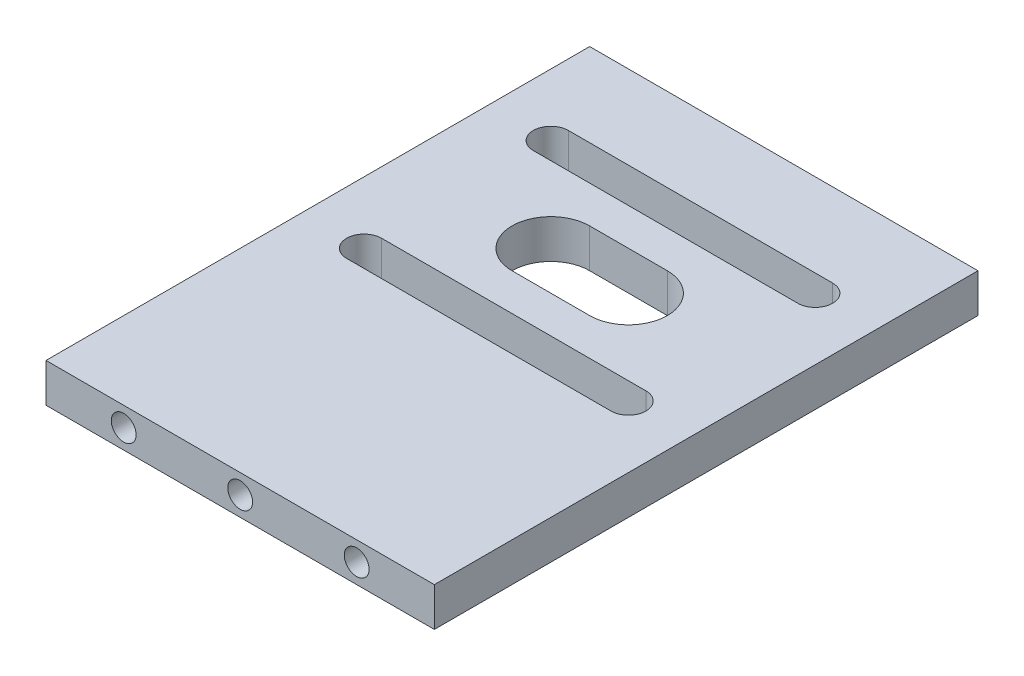
ISO-10303-21;
HEADER;
FILE_DESCRIPTION(('STEP AP214'),'2;1');
FILE_NAME('part.step','',(''),(''),'','','');
FILE_SCHEMA(('AUTOMOTIVE_DESIGN { 1 0 10303 214 1 1 1 1 }'));
ENDSEC;
DATA;
#1=APPLICATION_CONTEXT('core data for automotive mechanical design processes');
#2=APPLICATION_PROTOCOL_DEFINITION('international standard','automotive_design',2000,#1);
#3=PRODUCT_CONTEXT('',#1,'mechanical');
#4=PRODUCT('Part','Part','',(#3));
#5=PRODUCT_RELATED_PRODUCT_CATEGORY('part','',(#4));
#6=PRODUCT_DEFINITION_FORMATION('','',#4);
#7=PRODUCT_DEFINITION_CONTEXT('part definition',#1,'design');
#8=PRODUCT_DEFINITION('design','',#6,#7);
#9=PRODUCT_DEFINITION_SHAPE('','',#8);
#10=(LENGTH_UNIT() NAMED_UNIT(*) SI_UNIT(.MILLI.,.METRE.));
#11=(NAMED_UNIT(*) PLANE_ANGLE_UNIT() SI_UNIT($,.RADIAN.));
#12=(NAMED_UNIT(*) SI_UNIT($,.STERADIAN.) SOLID_ANGLE_UNIT());
#13=UNCERTAINTY_MEASURE_WITH_UNIT(LENGTH_MEASURE(1.E-05),#10,'distance_accuracy_value','');
#14=(GEOMETRIC_REPRESENTATION_CONTEXT(3) GLOBAL_UNCERTAINTY_ASSIGNED_CONTEXT((#13)) GLOBAL_UNIT_ASSIGNED_CONTEXT((#10,
#11,#12)) REPRESENTATION_CONTEXT('',''));
#15=CARTESIAN_POINT('',(0.,0.,0.));
#16=DIRECTION('',(0.,0.,1.));
#17=DIRECTION('',(1.,0.,0.));
#18=AXIS2_PLACEMENT_3D('',#15,#16,#17);
#19=CARTESIAN_POINT('',(0.,5.,0.));
#20=DIRECTION('',(0.,1.,0.));
#21=DIRECTION('',(0.,0.,1.));
#22=AXIS2_PLACEMENT_3D('',#19,#20,#21);
#23=PLANE('',#22);
#24=DIRECTION('',(0.,0.,1.));
#25=VECTOR('',#24,1.);
#26=CARTESIAN_POINT('',(-34.5750744686097,5.,-43.274395374361));
#27=LINE('',#26,#25);
#28=CARTESIAN_POINT('',(-34.5750744686097,5.,-43.274395374361));
#29=VERTEX_POINT('',#28);
#30=CARTESIAN_POINT('',(-34.5750744686097,5.,26.725604625639));
#31=VERTEX_POINT('',#30);
#32=EDGE_CURVE('E288',#29,#31,#27,.T.);
#33=ORIENTED_EDGE('',*,*,#32,.T.);
#34=DIRECTION('',(1.,0.,0.));
#35=VECTOR('',#34,1.);
#36=CARTESIAN_POINT('',(-34.5750744686097,5.,26.725604625639));
#37=LINE('',#36,#35);
#38=CARTESIAN_POINT('',(15.4249255313903,5.,26.725604625639));
#39=VERTEX_POINT('',#38);
#40=EDGE_CURVE('E292',#31,#39,#37,.T.);
#41=ORIENTED_EDGE('',*,*,#40,.T.);
#42=DIRECTION('',(0.,0.,-1.));
#43=VECTOR('',#42,1.);
#44=CARTESIAN_POINT('',(15.4249255313902,5.,-43.274395374361));
#45=LINE('',#44,#43);
#46=CARTESIAN_POINT('',(15.4249255313902,5.,-43.274395374361));
#47=VERTEX_POINT('',#46);
#48=EDGE_CURVE('E296',#39,#47,#45,.T.);
#49=ORIENTED_EDGE('',*,*,#48,.T.);
#50=DIRECTION('',(-1.,0.,0.));
#51=VECTOR('',#50,1.);
#52=CARTESIAN_POINT('',(-34.5750744686097,5.,-43.274395374361));
#53=LINE('',#52,#51);
#54=EDGE_CURVE('E299',#47,#29,#53,.T.);
#55=ORIENTED_EDGE('',*,*,#54,.T.);
#56=EDGE_LOOP('',(#33,#41,#49,#55));
#57=FACE_BOUND('',#56,.T.);
#58=DIRECTION('',(1.,0.,0.));
#59=VECTOR('',#58,1.);
#60=CARTESIAN_POINT('',(-26.5958897487811,5.,-28.0452106545323));
#61=LINE('',#60,#59);
#62=CARTESIAN_POINT('',(-26.5958897487811,5.,-28.0452106545323));
#63=VERTEX_POINT('',#62);
#64=CARTESIAN_POINT('',(7.44574081156156,5.,-28.0452106545323));
#65=VERTEX_POINT('',#64);
#66=EDGE_CURVE('E248',#63,#65,#61,.T.);
#67=ORIENTED_EDGE('',*,*,#66,.F.);
#68=CARTESIAN_POINT('',(-26.5958897487811,5.,-30.2952106545323));
#69=DIRECTION('',(0.,1.,0.));
#70=DIRECTION('',(0.,0.,1.));
#71=AXIS2_PLACEMENT_3D('',#68,#69,#70);
#72=CIRCLE('',#71,2.25000000000001);
#73=CARTESIAN_POINT('',(-26.5958897487811,5.,-32.5452106545323));
#74=VERTEX_POINT('',#73);
#75=EDGE_CURVE('E245',#74,#63,#72,.T.);
#76=ORIENTED_EDGE('',*,*,#75,.F.);
#77=DIRECTION('',(-1.,0.,0.));
#78=VECTOR('',#77,1.);
#79=CARTESIAN_POINT('',(-26.5958897487811,5.,-32.5452106545323));
#80=LINE('',#79,#78);
#81=CARTESIAN_POINT('',(7.44574081156156,5.,-32.5452106545323));
#82=VERTEX_POINT('',#81);
#83=EDGE_CURVE('E256',#82,#74,#80,.T.);
#84=ORIENTED_EDGE('',*,*,#83,.F.);
#85=CARTESIAN_POINT('',(7.44574081156156,5.,-30.2952106545323));
#86=DIRECTION('',(0.,1.,0.));
#87=DIRECTION('',(0.,0.,1.));
#88=AXIS2_PLACEMENT_3D('',#85,#86,#87);
#89=CIRCLE('',#88,2.25);
#90=EDGE_CURVE('E252',#65,#82,#89,.T.);
#91=ORIENTED_EDGE('',*,*,#90,.F.);
#92=EDGE_LOOP('',(#67,#76,#84,#91));
#93=FACE_BOUND('',#92,.T.);
#94=DIRECTION('',(1.,0.,0.));
#95=VECTOR('',#94,1.);
#96=CARTESIAN_POINT('',(-14.5750744686097,5.,-13.274395374361));
#97=LINE('',#96,#95);
#98=CARTESIAN_POINT('',(-14.5750744686097,5.,-13.274395374361));
#99=VERTEX_POINT('',#98);
#100=CARTESIAN_POINT('',(-4.57507446860975,5.,-13.274395374361));
#101=VERTEX_POINT('',#100);
#102=EDGE_CURVE('E205',#99,#101,#97,.T.);
#103=ORIENTED_EDGE('',*,*,#102,.F.);
#104=CARTESIAN_POINT('',(-14.5750744686097,5.,-18.274395374361));
#105=DIRECTION('',(0.,1.,0.));
#106=DIRECTION('',(0.,0.,1.));
#107=AXIS2_PLACEMENT_3D('',#104,#105,#106);
#108=CIRCLE('',#107,5.);
#109=CARTESIAN_POINT('',(-14.5750744686097,5.,-23.274395374361));
#110=VERTEX_POINT('',#109);
#111=EDGE_CURVE('E202',#110,#99,#108,.T.);
#112=ORIENTED_EDGE('',*,*,#111,.F.);
#113=DIRECTION('',(-1.,0.,0.));
#114=VECTOR('',#113,1.);
#115=CARTESIAN_POINT('',(-14.5750744686097,5.,-23.274395374361));
#116=LINE('',#115,#114);
#117=CARTESIAN_POINT('',(-4.57507446860975,5.,-23.274395374361));
#118=VERTEX_POINT('',#117);
#119=EDGE_CURVE('E213',#118,#110,#116,.T.);
#120=ORIENTED_EDGE('',*,*,#119,.F.);
#121=CARTESIAN_POINT('',(-4.57507446860975,5.,-18.274395374361));
#122=DIRECTION('',(0.,1.,0.));
#123=DIRECTION('',(0.,0.,1.));
#124=AXIS2_PLACEMENT_3D('',#121,#122,#123);
#125=CIRCLE('',#124,5.);
#126=EDGE_CURVE('E209',#101,#118,#125,.T.);
#127=ORIENTED_EDGE('',*,*,#126,.F.);
#128=EDGE_LOOP('',(#103,#112,#120,#127));
#129=FACE_BOUND('',#128,.T.);
#130=DIRECTION('',(1.,0.,0.));
#131=VECTOR('',#130,1.);
#132=CARTESIAN_POINT('',(-26.5958897487811,5.,-4.00358009418965));
#133=LINE('',#132,#131);
#134=CARTESIAN_POINT('',(-26.5958897487811,5.,-4.00358009418965));
#135=VERTEX_POINT('',#134);
#136=CARTESIAN_POINT('',(7.44574081156156,5.,-4.00358009418966));
#137=VERTEX_POINT('',#136);
#138=EDGE_CURVE('E161',#135,#137,#133,.T.);
#139=ORIENTED_EDGE('',*,*,#138,.F.);
#140=CARTESIAN_POINT('',(-26.5958897487811,5.,-6.25358009418965));
#141=DIRECTION('',(0.,1.,0.));
#142=DIRECTION('',(0.,0.,-1.));
#143=AXIS2_PLACEMENT_3D('',#140,#141,#142);
#144=CIRCLE('',#143,2.25000000000001);
#145=CARTESIAN_POINT('',(-26.5958897487811,5.,-8.50358009418967));
#146=VERTEX_POINT('',#145);
#147=EDGE_CURVE('E152',#146,#135,#144,.T.);
#148=ORIENTED_EDGE('',*,*,#147,.F.);
#149=DIRECTION('',(-1.,0.,0.));
#150=VECTOR('',#149,1.);
#151=CARTESIAN_POINT('',(-26.5958897487811,5.,-8.50358009418967));
#152=LINE('',#151,#150);
#153=CARTESIAN_POINT('',(7.44574081156156,5.,-8.50358009418966));
#154=VERTEX_POINT('',#153);
#155=EDGE_CURVE('E178',#154,#146,#152,.T.);
#156=ORIENTED_EDGE('',*,*,#155,.F.);
#157=CARTESIAN_POINT('',(7.44574081156156,5.,-6.25358009418966));
#158=DIRECTION('',(0.,1.,0.));
#159=DIRECTION('',(0.,0.,-1.));
#160=AXIS2_PLACEMENT_3D('',#157,#158,#159);
#161=CIRCLE('',#160,2.25);
#162=EDGE_CURVE('E174',#137,#154,#161,.T.);
#163=ORIENTED_EDGE('',*,*,#162,.F.);
#164=EDGE_LOOP('',(#139,#148,#156,#163));
#165=FACE_BOUND('',#164,.T.);
#166=ADVANCED_FACE('F38',(#57,#93,#129,#165),#23,.T.);
#167=CARTESIAN_POINT('',(0.,0.,0.));
#168=DIRECTION('',(0.,1.,0.));
#169=DIRECTION('',(0.,0.,1.));
#170=AXIS2_PLACEMENT_3D('',#167,#168,#169);
#171=PLANE('',#170);
#172=CARTESIAN_POINT('',(-14.5750744686097,0.,-18.274395374361));
#173=DIRECTION('',(0.,1.,0.));
#174=DIRECTION('',(0.,0.,1.));
#175=AXIS2_PLACEMENT_3D('',#172,#173,#174);
#176=CIRCLE('',#175,5.);
#177=CARTESIAN_POINT('',(-14.5750744686097,0.,-23.274395374361));
#178=VERTEX_POINT('',#177);
#179=CARTESIAN_POINT('',(-14.5750744686097,0.,-13.274395374361));
#180=VERTEX_POINT('',#179);
#181=EDGE_CURVE('E170',#178,#180,#176,.T.);
#182=ORIENTED_EDGE('',*,*,#181,.T.);
#183=DIRECTION('',(1.,0.,0.));
#184=VECTOR('',#183,1.);
#185=CARTESIAN_POINT('',(-14.5750744686097,0.,-13.274395374361));
#186=LINE('',#185,#184);
#187=CARTESIAN_POINT('',(-4.57507446860975,0.,-13.274395374361));
#188=VERTEX_POINT('',#187);
#189=EDGE_CURVE('E220',#180,#188,#186,.T.);
#190=ORIENTED_EDGE('',*,*,#189,.T.);
#191=CARTESIAN_POINT('',(-4.57507446860975,0.,-18.274395374361));
#192=DIRECTION('',(0.,1.,0.));
#193=DIRECTION('',(0.,0.,1.));
#194=AXIS2_PLACEMENT_3D('',#191,#192,#193);
#195=CIRCLE('',#194,5.);
#196=CARTESIAN_POINT('',(-4.57507446860975,0.,-23.274395374361));
#197=VERTEX_POINT('',#196);
#198=EDGE_CURVE('E224',#188,#197,#195,.T.);
#199=ORIENTED_EDGE('',*,*,#198,.T.);
#200=DIRECTION('',(-1.,0.,0.));
#201=VECTOR('',#200,1.);
#202=CARTESIAN_POINT('',(-14.5750744686097,0.,-23.274395374361));
#203=LINE('',#202,#201);
#204=EDGE_CURVE('E206',#197,#178,#203,.T.);
#205=ORIENTED_EDGE('',*,*,#204,.T.);
#206=EDGE_LOOP('',(#182,#190,#199,#205));
#207=FACE_BOUND('',#206,.T.);
#208=DIRECTION('',(0.,0.,1.));
#209=VECTOR('',#208,1.);
#210=CARTESIAN_POINT('',(-34.5750744686097,0.,-43.274395374361));
#211=LINE('',#210,#209);
#212=CARTESIAN_POINT('',(-34.5750744686097,0.,-43.274395374361));
#213=VERTEX_POINT('',#212);
#214=CARTESIAN_POINT('',(-34.5750744686097,0.,26.725604625639));
#215=VERTEX_POINT('',#214);
#216=EDGE_CURVE('E287',#213,#215,#211,.T.);
#217=ORIENTED_EDGE('',*,*,#216,.F.);
#218=DIRECTION('',(-1.,0.,0.));
#219=VECTOR('',#218,1.);
#220=CARTESIAN_POINT('',(-34.5750744686097,0.,-43.274395374361));
#221=LINE('',#220,#219);
#222=CARTESIAN_POINT('',(15.4249255313902,0.,-43.274395374361));
#223=VERTEX_POINT('',#222);
#224=EDGE_CURVE('E293',#223,#213,#221,.T.);
#225=ORIENTED_EDGE('',*,*,#224,.F.);
#226=DIRECTION('',(0.,0.,-1.));
#227=VECTOR('',#226,1.);
#228=CARTESIAN_POINT('',(15.4249255313902,0.,-43.274395374361));
#229=LINE('',#228,#227);
#230=CARTESIAN_POINT('',(15.4249255313903,0.,26.725604625639));
#231=VERTEX_POINT('',#230);
#232=EDGE_CURVE('E309',#231,#223,#229,.T.);
#233=ORIENTED_EDGE('',*,*,#232,.F.);
#234=DIRECTION('',(1.,0.,0.));
#235=VECTOR('',#234,1.);
#236=CARTESIAN_POINT('',(-34.5750744686097,0.,26.725604625639));
#237=LINE('',#236,#235);
#238=EDGE_CURVE('E306',#215,#231,#237,.T.);
#239=ORIENTED_EDGE('',*,*,#238,.F.);
#240=EDGE_LOOP('',(#217,#225,#233,#239));
#241=FACE_BOUND('',#240,.T.);
#242=CARTESIAN_POINT('',(-26.5958897487811,0.,-30.2952106545323));
#243=DIRECTION('',(0.,1.,0.));
#244=DIRECTION('',(0.,0.,1.));
#245=AXIS2_PLACEMENT_3D('',#242,#243,#244);
#246=CIRCLE('',#245,2.25000000000001);
#247=CARTESIAN_POINT('',(-26.5958897487811,0.,-32.5452106545323));
#248=VERTEX_POINT('',#247);
#249=CARTESIAN_POINT('',(-26.5958897487811,0.,-28.0452106545323));
#250=VERTEX_POINT('',#249);
#251=EDGE_CURVE('E244',#248,#250,#246,.T.);
#252=ORIENTED_EDGE('',*,*,#251,.T.);
#253=DIRECTION('',(1.,0.,0.));
#254=VECTOR('',#253,1.);
#255=CARTESIAN_POINT('',(-26.5958897487811,0.,-28.0452106545323));
#256=LINE('',#255,#254);
#257=CARTESIAN_POINT('',(7.44574081156156,0.,-28.0452106545323));
#258=VERTEX_POINT('',#257);
#259=EDGE_CURVE('E263',#250,#258,#256,.T.);
#260=ORIENTED_EDGE('',*,*,#259,.T.);
#261=CARTESIAN_POINT('',(7.44574081156156,0.,-30.2952106545323));
#262=DIRECTION('',(0.,1.,0.));
#263=DIRECTION('',(0.,0.,1.));
#264=AXIS2_PLACEMENT_3D('',#261,#262,#263);
#265=CIRCLE('',#264,2.25);
#266=CARTESIAN_POINT('',(7.44574081156156,0.,-32.5452106545323));
#267=VERTEX_POINT('',#266);
#268=EDGE_CURVE('E267',#258,#267,#265,.T.);
#269=ORIENTED_EDGE('',*,*,#268,.T.);
#270=DIRECTION('',(-1.,0.,0.));
#271=VECTOR('',#270,1.);
#272=CARTESIAN_POINT('',(-26.5958897487811,0.,-32.5452106545323));
#273=LINE('',#272,#271);
#274=EDGE_CURVE('E249',#267,#248,#273,.T.);
#275=ORIENTED_EDGE('',*,*,#274,.T.);
#276=EDGE_LOOP('',(#252,#260,#269,#275));
#277=FACE_BOUND('',#276,.T.);
#278=CARTESIAN_POINT('',(-26.5958897487811,0.,-6.25358009418965));
#279=DIRECTION('',(0.,1.,0.));
#280=DIRECTION('',(0.,0.,-1.));
#281=AXIS2_PLACEMENT_3D('',#278,#279,#280);
#282=CIRCLE('',#281,2.25000000000001);
#283=CARTESIAN_POINT('',(-26.5958897487811,0.,-8.50358009418967));
#284=VERTEX_POINT('',#283);
#285=CARTESIAN_POINT('',(-26.5958897487811,0.,-4.00358009418965));
#286=VERTEX_POINT('',#285);
#287=EDGE_CURVE('E62',#284,#286,#282,.T.);
#288=ORIENTED_EDGE('',*,*,#287,.T.);
#289=DIRECTION('',(1.,0.,0.));
#290=VECTOR('',#289,1.);
#291=CARTESIAN_POINT('',(-26.5958897487811,0.,-4.00358009418965));
#292=LINE('',#291,#290);
#293=CARTESIAN_POINT('',(7.44574081156156,0.,-4.00358009418966));
#294=VERTEX_POINT('',#293);
#295=EDGE_CURVE('E168',#286,#294,#292,.T.);
#296=ORIENTED_EDGE('',*,*,#295,.T.);
#297=CARTESIAN_POINT('',(7.44574081156156,0.,-6.25358009418966));
#298=DIRECTION('',(0.,1.,0.));
#299=DIRECTION('',(0.,0.,-1.));
#300=AXIS2_PLACEMENT_3D('',#297,#298,#299);
#301=CIRCLE('',#300,2.25);
#302=CARTESIAN_POINT('',(7.44574081156156,0.,-8.50358009418966));
#303=VERTEX_POINT('',#302);
#304=EDGE_CURVE('E189',#294,#303,#301,.T.);
#305=ORIENTED_EDGE('',*,*,#304,.T.);
#306=DIRECTION('',(-1.,0.,0.));
#307=VECTOR('',#306,1.);
#308=CARTESIAN_POINT('',(-26.5958897487811,0.,-8.50358009418967));
#309=LINE('',#308,#307);
#310=EDGE_CURVE('E162',#303,#284,#309,.T.);
#311=ORIENTED_EDGE('',*,*,#310,.T.);
#312=EDGE_LOOP('',(#288,#296,#305,#311));
#313=FACE_BOUND('',#312,.T.);
#314=ADVANCED_FACE('F332',(#207,#241,#277,#313),#171,.F.);
#315=CARTESIAN_POINT('',(-34.5750744686097,5.,-43.274395374361));
#316=DIRECTION('',(1.,0.,0.));
#317=DIRECTION('',(0.,0.,-1.));
#318=AXIS2_PLACEMENT_3D('',#315,#316,#317);
#319=PLANE('',#318);
#320=ORIENTED_EDGE('',*,*,#216,.T.);
#321=DIRECTION('',(0.,-1.,0.));
#322=VECTOR('',#321,1.);
#323=CARTESIAN_POINT('',(-34.5750744686097,5.,26.725604625639));
#324=LINE('',#323,#322);
#325=EDGE_CURVE('E11',#31,#215,#324,.T.);
#326=ORIENTED_EDGE('',*,*,#325,.F.);
#327=ORIENTED_EDGE('',*,*,#32,.F.);
#328=DIRECTION('',(0.,-1.,0.));
#329=VECTOR('',#328,1.);
#330=CARTESIAN_POINT('',(-34.5750744686097,5.,-43.274395374361));
#331=LINE('',#330,#329);
#332=EDGE_CURVE('E302',#29,#213,#331,.T.);
#333=ORIENTED_EDGE('',*,*,#332,.T.);
#334=EDGE_LOOP('',(#320,#326,#327,#333));
#335=FACE_BOUND('',#334,.T.);
#336=ADVANCED_FACE('F40',(#335),#319,.F.);
#337=CARTESIAN_POINT('',(-34.5750744686097,5.,26.725604625639));
#338=DIRECTION('',(0.,0.,-1.));
#339=DIRECTION('',(-1.,0.,0.));
#340=AXIS2_PLACEMENT_3D('',#337,#338,#339);
#341=PLANE('',#340);
#342=CARTESIAN_POINT('',(5.42492553139025,2.5,26.725604625639));
#343=DIRECTION('',(0.,0.,1.));
#344=DIRECTION('',(-1.,0.,0.));
#345=AXIS2_PLACEMENT_3D('',#342,#343,#344);
#346=CIRCLE('',#345,1.6);
#347=CARTESIAN_POINT('',(3.82492553139025,2.5,26.725604625639));
#348=VERTEX_POINT('',#347);
#349=EDGE_CURVE('E554',#348,#348,#346,.T.);
#350=ORIENTED_EDGE('',*,*,#349,.F.);
#351=EDGE_LOOP('',(#350));
#352=FACE_BOUND('',#351,.T.);
#353=CARTESIAN_POINT('',(-24.5750744686097,2.5,26.725604625639));
#354=DIRECTION('',(0.,0.,1.));
#355=DIRECTION('',(1.,0.,0.));
#356=AXIS2_PLACEMENT_3D('',#353,#354,#355);
#357=CIRCLE('',#356,1.6);
#358=CARTESIAN_POINT('',(-22.9750744686097,2.5,26.725604625639));
#359=VERTEX_POINT('',#358);
#360=EDGE_CURVE('E553',#359,#359,#357,.T.);
#361=ORIENTED_EDGE('',*,*,#360,.F.);
#362=EDGE_LOOP('',(#361));
#363=FACE_BOUND('',#362,.T.);
#364=CARTESIAN_POINT('',(-9.57507446860975,2.5,26.725604625639));
#365=DIRECTION('',(0.,0.,1.));
#366=DIRECTION('',(1.,0.,0.));
#367=AXIS2_PLACEMENT_3D('',#364,#365,#366);
#368=CIRCLE('',#367,1.6);
#369=CARTESIAN_POINT('',(-7.97507446860975,2.5,26.725604625639));
#370=VERTEX_POINT('',#369);
#371=EDGE_CURVE('E567',#370,#370,#368,.T.);
#372=ORIENTED_EDGE('',*,*,#371,.F.);
#373=EDGE_LOOP('',(#372));
#374=FACE_BOUND('',#373,.T.);
#375=ORIENTED_EDGE('',*,*,#238,.T.);
#376=DIRECTION('',(0.,-1.,0.));
#377=VECTOR('',#376,1.);
#378=CARTESIAN_POINT('',(15.4249255313903,5.,26.725604625639));
#379=LINE('',#378,#377);
#380=EDGE_CURVE('E47',#39,#231,#379,.T.);
#381=ORIENTED_EDGE('',*,*,#380,.F.);
#382=ORIENTED_EDGE('',*,*,#40,.F.);
#383=ORIENTED_EDGE('',*,*,#325,.T.);
#384=EDGE_LOOP('',(#375,#381,#382,#383));
#385=FACE_BOUND('',#384,.T.);
#386=ADVANCED_FACE('F343',(#352,#363,#374,#385),#341,.F.);
#387=CARTESIAN_POINT('',(15.4249255313902,5.,-43.274395374361));
#388=DIRECTION('',(-1.,0.,0.));
#389=DIRECTION('',(0.,0.,1.));
#390=AXIS2_PLACEMENT_3D('',#387,#388,#389);
#391=PLANE('',#390);
#392=ORIENTED_EDGE('',*,*,#232,.T.);
#393=DIRECTION('',(0.,-1.,0.));
#394=VECTOR('',#393,1.);
#395=CARTESIAN_POINT('',(15.4249255313902,5.,-43.274395374361));
#396=LINE('',#395,#394);
#397=EDGE_CURVE('E317',#47,#223,#396,.T.);
#398=ORIENTED_EDGE('',*,*,#397,.F.);
#399=ORIENTED_EDGE('',*,*,#48,.F.);
#400=ORIENTED_EDGE('',*,*,#380,.T.);
#401=EDGE_LOOP('',(#392,#398,#399,#400));
#402=FACE_BOUND('',#401,.T.);
#403=ADVANCED_FACE('F326',(#402),#391,.F.);
#404=CARTESIAN_POINT('',(-34.5750744686097,5.,-43.274395374361));
#405=DIRECTION('',(0.,0.,1.));
#406=DIRECTION('',(1.,0.,0.));
#407=AXIS2_PLACEMENT_3D('',#404,#405,#406);
#408=PLANE('',#407);
#409=ORIENTED_EDGE('',*,*,#224,.T.);
#410=ORIENTED_EDGE('',*,*,#332,.F.);
#411=ORIENTED_EDGE('',*,*,#54,.F.);
#412=ORIENTED_EDGE('',*,*,#397,.T.);
#413=EDGE_LOOP('',(#409,#410,#411,#412));
#414=FACE_BOUND('',#413,.T.);
#415=ADVANCED_FACE('F336',(#414),#408,.F.);
#416=CARTESIAN_POINT('',(-26.5958897487811,5.,-30.2952106545323));
#417=DIRECTION('',(0.,-1.,0.));
#418=DIRECTION('',(0.,0.,-1.));
#419=AXIS2_PLACEMENT_3D('',#416,#417,#418);
#420=CYLINDRICAL_SURFACE('',#419,2.25000000000001);
#421=ORIENTED_EDGE('',*,*,#251,.F.);
#422=DIRECTION('',(0.,-1.,0.));
#423=VECTOR('',#422,1.);
#424=CARTESIAN_POINT('',(-26.5958897487811,5.,-32.5452106545323));
#425=LINE('',#424,#423);
#426=EDGE_CURVE('E259',#74,#248,#425,.T.);
#427=ORIENTED_EDGE('',*,*,#426,.F.);
#428=ORIENTED_EDGE('',*,*,#75,.T.);
#429=DIRECTION('',(0.,-1.,0.));
#430=VECTOR('',#429,1.);
#431=CARTESIAN_POINT('',(-26.5958897487811,5.,-28.0452106545323));
#432=LINE('',#431,#430);
#433=EDGE_CURVE('E283',#63,#250,#432,.T.);
#434=ORIENTED_EDGE('',*,*,#433,.T.);
#435=EDGE_LOOP('',(#421,#427,#428,#434));
#436=FACE_BOUND('',#435,.T.);
#437=ADVANCED_FACE('F361',(#436),#420,.F.);
#438=CARTESIAN_POINT('',(-26.5958897487811,5.,-28.0452106545323));
#439=DIRECTION('',(0.,0.,-1.));
#440=DIRECTION('',(-1.,0.,0.));
#441=AXIS2_PLACEMENT_3D('',#438,#439,#440);
#442=PLANE('',#441);
#443=ORIENTED_EDGE('',*,*,#259,.F.);
#444=ORIENTED_EDGE('',*,*,#433,.F.);
#445=ORIENTED_EDGE('',*,*,#66,.T.);
#446=DIRECTION('',(0.,-1.,0.));
#447=VECTOR('',#446,1.);
#448=CARTESIAN_POINT('',(7.44574081156156,5.,-28.0452106545323));
#449=LINE('',#448,#447);
#450=EDGE_CURVE('E280',#65,#258,#449,.T.);
#451=ORIENTED_EDGE('',*,*,#450,.T.);
#452=EDGE_LOOP('',(#443,#444,#445,#451));
#453=FACE_BOUND('',#452,.T.);
#454=ADVANCED_FACE('F368',(#453),#442,.T.);
#455=CARTESIAN_POINT('',(7.44574081156156,5.,-30.2952106545323));
#456=DIRECTION('',(0.,-1.,0.));
#457=DIRECTION('',(0.,0.,-1.));
#458=AXIS2_PLACEMENT_3D('',#455,#456,#457);
#459=CYLINDRICAL_SURFACE('',#458,2.25);
#460=ORIENTED_EDGE('',*,*,#268,.F.);
#461=ORIENTED_EDGE('',*,*,#450,.F.);
#462=ORIENTED_EDGE('',*,*,#90,.T.);
#463=DIRECTION('',(0.,-1.,0.));
#464=VECTOR('',#463,1.);
#465=CARTESIAN_POINT('',(7.44574081156156,5.,-32.5452106545323));
#466=LINE('',#465,#464);
#467=EDGE_CURVE('E277',#82,#267,#466,.T.);
#468=ORIENTED_EDGE('',*,*,#467,.T.);
#469=EDGE_LOOP('',(#460,#461,#462,#468));
#470=FACE_BOUND('',#469,.T.);
#471=ADVANCED_FACE('F373',(#470),#459,.F.);
#472=CARTESIAN_POINT('',(-26.5958897487811,5.,-32.5452106545323));
#473=DIRECTION('',(0.,0.,1.));
#474=DIRECTION('',(1.,0.,0.));
#475=AXIS2_PLACEMENT_3D('',#472,#473,#474);
#476=PLANE('',#475);
#477=ORIENTED_EDGE('',*,*,#274,.F.);
#478=ORIENTED_EDGE('',*,*,#467,.F.);
#479=ORIENTED_EDGE('',*,*,#83,.T.);
#480=ORIENTED_EDGE('',*,*,#426,.T.);
#481=EDGE_LOOP('',(#477,#478,#479,#480));
#482=FACE_BOUND('',#481,.T.);
#483=ADVANCED_FACE('F380',(#482),#476,.T.);
#484=CARTESIAN_POINT('',(-14.5750744686097,5.,-18.274395374361));
#485=DIRECTION('',(0.,-1.,0.));
#486=DIRECTION('',(0.,0.,-1.));
#487=AXIS2_PLACEMENT_3D('',#484,#485,#486);
#488=CYLINDRICAL_SURFACE('',#487,5.);
#489=ORIENTED_EDGE('',*,*,#181,.F.);
#490=DIRECTION('',(0.,-1.,0.));
#491=VECTOR('',#490,1.);
#492=CARTESIAN_POINT('',(-14.5750744686097,5.,-23.274395374361));
#493=LINE('',#492,#491);
#494=EDGE_CURVE('E216',#110,#178,#493,.T.);
#495=ORIENTED_EDGE('',*,*,#494,.F.);
#496=ORIENTED_EDGE('',*,*,#111,.T.);
#497=DIRECTION('',(0.,-1.,0.));
#498=VECTOR('',#497,1.);
#499=CARTESIAN_POINT('',(-14.5750744686097,5.,-13.274395374361));
#500=LINE('',#499,#498);
#501=EDGE_CURVE('E240',#99,#180,#500,.T.);
#502=ORIENTED_EDGE('',*,*,#501,.T.);
#503=EDGE_LOOP('',(#489,#495,#496,#502));
#504=FACE_BOUND('',#503,.T.);
#505=ADVANCED_FACE('F402',(#504),#488,.F.);
#506=CARTESIAN_POINT('',(-14.5750744686097,5.,-13.274395374361));
#507=DIRECTION('',(0.,0.,-1.));
#508=DIRECTION('',(-1.,0.,0.));
#509=AXIS2_PLACEMENT_3D('',#506,#507,#508);
#510=PLANE('',#509);
#511=ORIENTED_EDGE('',*,*,#189,.F.);
#512=ORIENTED_EDGE('',*,*,#501,.F.);
#513=ORIENTED_EDGE('',*,*,#102,.T.);
#514=DIRECTION('',(0.,-1.,0.));
#515=VECTOR('',#514,1.);
#516=CARTESIAN_POINT('',(-4.57507446860975,5.,-13.274395374361));
#517=LINE('',#516,#515);
#518=EDGE_CURVE('E237',#101,#188,#517,.T.);
#519=ORIENTED_EDGE('',*,*,#518,.T.);
#520=EDGE_LOOP('',(#511,#512,#513,#519));
#521=FACE_BOUND('',#520,.T.);
#522=ADVANCED_FACE('F396',(#521),#510,.T.);
#523=CARTESIAN_POINT('',(-4.57507446860975,5.,-18.274395374361));
#524=DIRECTION('',(0.,-1.,0.));
#525=DIRECTION('',(0.,0.,-1.));
#526=AXIS2_PLACEMENT_3D('',#523,#524,#525);
#527=CYLINDRICAL_SURFACE('',#526,5.);
#528=ORIENTED_EDGE('',*,*,#198,.F.);
#529=ORIENTED_EDGE('',*,*,#518,.F.);
#530=ORIENTED_EDGE('',*,*,#126,.T.);
#531=DIRECTION('',(0.,-1.,0.));
#532=VECTOR('',#531,1.);
#533=CARTESIAN_POINT('',(-4.57507446860975,5.,-23.274395374361));
#534=LINE('',#533,#532);
#535=EDGE_CURVE('E234',#118,#197,#534,.T.);
#536=ORIENTED_EDGE('',*,*,#535,.T.);
#537=EDGE_LOOP('',(#528,#529,#530,#536));
#538=FACE_BOUND('',#537,.T.);
#539=ADVANCED_FACE('F399',(#538),#527,.F.);
#540=CARTESIAN_POINT('',(-14.5750744686097,5.,-23.274395374361));
#541=DIRECTION('',(0.,0.,1.));
#542=DIRECTION('',(1.,0.,0.));
#543=AXIS2_PLACEMENT_3D('',#540,#541,#542);
#544=PLANE('',#543);
#545=ORIENTED_EDGE('',*,*,#204,.F.);
#546=ORIENTED_EDGE('',*,*,#535,.F.);
#547=ORIENTED_EDGE('',*,*,#119,.T.);
#548=ORIENTED_EDGE('',*,*,#494,.T.);
#549=EDGE_LOOP('',(#545,#546,#547,#548));
#550=FACE_BOUND('',#549,.T.);
#551=ADVANCED_FACE('F405',(#550),#544,.T.);
#552=CARTESIAN_POINT('',(-26.5958897487811,5.,-6.25358009418965));
#553=DIRECTION('',(0.,-1.,0.));
#554=DIRECTION('',(0.,0.,-1.));
#555=AXIS2_PLACEMENT_3D('',#552,#553,#554);
#556=CYLINDRICAL_SURFACE('',#555,2.25000000000001);
#557=ORIENTED_EDGE('',*,*,#287,.F.);
#558=DIRECTION('',(0.,-1.,0.));
#559=VECTOR('',#558,1.);
#560=CARTESIAN_POINT('',(-26.5958897487811,5.,-8.50358009418967));
#561=LINE('',#560,#559);
#562=EDGE_CURVE('E156',#146,#284,#561,.T.);
#563=ORIENTED_EDGE('',*,*,#562,.F.);
#564=ORIENTED_EDGE('',*,*,#147,.T.);
#565=DIRECTION('',(0.,-1.,0.));
#566=VECTOR('',#565,1.);
#567=CARTESIAN_POINT('',(-26.5958897487811,5.,-4.00358009418965));
#568=LINE('',#567,#566);
#569=EDGE_CURVE('E155',#135,#286,#568,.T.);
#570=ORIENTED_EDGE('',*,*,#569,.T.);
#571=EDGE_LOOP('',(#557,#563,#564,#570));
#572=FACE_BOUND('',#571,.T.);
#573=ADVANCED_FACE('F154',(#572),#556,.F.);
#574=CARTESIAN_POINT('',(-26.5958897487811,5.,-4.00358009418965));
#575=DIRECTION('',(0.,0.,-1.));
#576=DIRECTION('',(-1.,0.,0.));
#577=AXIS2_PLACEMENT_3D('',#574,#575,#576);
#578=PLANE('',#577);
#579=ORIENTED_EDGE('',*,*,#295,.F.);
#580=ORIENTED_EDGE('',*,*,#569,.F.);
#581=ORIENTED_EDGE('',*,*,#138,.T.);
#582=DIRECTION('',(0.,-1.,0.));
#583=VECTOR('',#582,1.);
#584=CARTESIAN_POINT('',(7.44574081156156,5.,-4.00358009418966));
#585=LINE('',#584,#583);
#586=EDGE_CURVE('E171',#137,#294,#585,.T.);
#587=ORIENTED_EDGE('',*,*,#586,.T.);
#588=EDGE_LOOP('',(#579,#580,#581,#587));
#589=FACE_BOUND('',#588,.T.);
#590=ADVANCED_FACE('F165',(#589),#578,.T.);
#591=CARTESIAN_POINT('',(7.44574081156156,5.,-6.25358009418966));
#592=DIRECTION('',(0.,-1.,0.));
#593=DIRECTION('',(0.,0.,-1.));
#594=AXIS2_PLACEMENT_3D('',#591,#592,#593);
#595=CYLINDRICAL_SURFACE('',#594,2.25);
#596=ORIENTED_EDGE('',*,*,#304,.F.);
#597=ORIENTED_EDGE('',*,*,#586,.F.);
#598=ORIENTED_EDGE('',*,*,#162,.T.);
#599=DIRECTION('',(0.,-1.,0.));
#600=VECTOR('',#599,1.);
#601=CARTESIAN_POINT('',(7.44574081156156,5.,-8.50358009418966));
#602=LINE('',#601,#600);
#603=EDGE_CURVE('E54',#154,#303,#602,.T.);
#604=ORIENTED_EDGE('',*,*,#603,.T.);
#605=EDGE_LOOP('',(#596,#597,#598,#604));
#606=FACE_BOUND('',#605,.T.);
#607=ADVANCED_FACE('F462',(#606),#595,.F.);
#608=CARTESIAN_POINT('',(-26.5958897487811,5.,-8.50358009418967));
#609=DIRECTION('',(0.,0.,1.));
#610=DIRECTION('',(1.,0.,0.));
#611=AXIS2_PLACEMENT_3D('',#608,#609,#610);
#612=PLANE('',#611);
#613=ORIENTED_EDGE('',*,*,#310,.F.);
#614=ORIENTED_EDGE('',*,*,#603,.F.);
#615=ORIENTED_EDGE('',*,*,#155,.T.);
#616=ORIENTED_EDGE('',*,*,#562,.T.);
#617=EDGE_LOOP('',(#613,#614,#615,#616));
#618=FACE_BOUND('',#617,.T.);
#619=ADVANCED_FACE('F470',(#618),#612,.T.);
#620=CARTESIAN_POINT('',(-9.57507446860975,2.5,16.725604625639));
#621=DIRECTION('',(0.,0.,1.));
#622=DIRECTION('',(1.,0.,0.));
#623=AXIS2_PLACEMENT_3D('',#620,#621,#622);
#624=CYLINDRICAL_SURFACE('',#623,1.6);
#625=CARTESIAN_POINT('',(-9.57507446860975,2.5,16.725604625639));
#626=DIRECTION('',(0.,0.,1.));
#627=DIRECTION('',(1.,0.,0.));
#628=AXIS2_PLACEMENT_3D('',#625,#626,#627);
#629=CIRCLE('',#628,1.6);
#630=CARTESIAN_POINT('',(-7.97507446860975,2.5,16.725604625639));
#631=VERTEX_POINT('',#630);
#632=EDGE_CURVE('E186',#631,#631,#629,.T.);
#633=ORIENTED_EDGE('',*,*,#632,.F.);
#634=EDGE_LOOP('',(#633));
#635=FACE_BOUND('',#634,.T.);
#636=ORIENTED_EDGE('',*,*,#371,.T.);
#637=EDGE_LOOP('',(#636));
#638=FACE_BOUND('',#637,.T.);
#639=ADVANCED_FACE('F479',(#635,#638),#624,.F.);
#640=CARTESIAN_POINT('',(-9.57507446860975,2.5,16.725604625639));
#641=DIRECTION('',(0.,0.,1.));
#642=DIRECTION('',(1.,0.,0.));
#643=AXIS2_PLACEMENT_3D('',#640,#641,#642);
#644=PLANE('',#643);
#645=ORIENTED_EDGE('',*,*,#632,.T.);
#646=EDGE_LOOP('',(#645));
#647=FACE_BOUND('',#646,.T.);
#648=ADVANCED_FACE('F495',(#647),#644,.T.);
#649=CARTESIAN_POINT('',(-24.5750744686097,2.5,16.725604625639));
#650=DIRECTION('',(0.,0.,1.));
#651=DIRECTION('',(1.,0.,0.));
#652=AXIS2_PLACEMENT_3D('',#649,#650,#651);
#653=CYLINDRICAL_SURFACE('',#652,1.6);
#654=CARTESIAN_POINT('',(-24.5750744686097,2.5,16.725604625639));
#655=DIRECTION('',(0.,0.,1.));
#656=DIRECTION('',(1.,0.,0.));
#657=AXIS2_PLACEMENT_3D('',#654,#655,#656);
#658=CIRCLE('',#657,1.6);
#659=CARTESIAN_POINT('',(-22.9750744686097,2.5,16.725604625639));
#660=VERTEX_POINT('',#659);
#661=EDGE_CURVE('E559',#660,#660,#658,.T.);
#662=ORIENTED_EDGE('',*,*,#661,.F.);
#663=EDGE_LOOP('',(#662));
#664=FACE_BOUND('',#663,.T.);
#665=ORIENTED_EDGE('',*,*,#360,.T.);
#666=EDGE_LOOP('',(#665));
#667=FACE_BOUND('',#666,.T.);
#668=ADVANCED_FACE('F505',(#664,#667),#653,.F.);
#669=CARTESIAN_POINT('',(-24.5750744686097,2.5,16.725604625639));
#670=DIRECTION('',(0.,0.,1.));
#671=DIRECTION('',(1.,0.,0.));
#672=AXIS2_PLACEMENT_3D('',#669,#670,#671);
#673=PLANE('',#672);
#674=ORIENTED_EDGE('',*,*,#661,.T.);
#675=EDGE_LOOP('',(#674));
#676=FACE_BOUND('',#675,.T.);
#677=ADVANCED_FACE('F515',(#676),#673,.T.);
#678=CARTESIAN_POINT('',(5.42492553139025,2.5,16.725604625639));
#679=DIRECTION('',(0.,0.,1.));
#680=DIRECTION('',(1.,0.,0.));
#681=AXIS2_PLACEMENT_3D('',#678,#679,#680);
#682=CYLINDRICAL_SURFACE('',#681,1.6);
#683=CARTESIAN_POINT('',(5.42492553139025,2.5,16.725604625639));
#684=DIRECTION('',(0.,0.,1.));
#685=DIRECTION('',(-1.,0.,0.));
#686=AXIS2_PLACEMENT_3D('',#683,#684,#685);
#687=CIRCLE('',#686,1.6);
#688=CARTESIAN_POINT('',(3.82492553139025,2.5,16.725604625639));
#689=VERTEX_POINT('',#688);
#690=EDGE_CURVE('E551',#689,#689,#687,.T.);
#691=ORIENTED_EDGE('',*,*,#690,.F.);
#692=EDGE_LOOP('',(#691));
#693=FACE_BOUND('',#692,.T.);
#694=ORIENTED_EDGE('',*,*,#349,.T.);
#695=EDGE_LOOP('',(#694));
#696=FACE_BOUND('',#695,.T.);
#697=ADVANCED_FACE('F525',(#693,#696),#682,.F.);
#698=CARTESIAN_POINT('',(5.42492553139025,2.5,16.725604625639));
#699=DIRECTION('',(0.,0.,-1.));
#700=DIRECTION('',(-1.,0.,0.));
#701=AXIS2_PLACEMENT_3D('',#698,#699,#700);
#702=PLANE('',#701);
#703=ORIENTED_EDGE('',*,*,#690,.T.);
#704=EDGE_LOOP('',(#703));
#705=FACE_BOUND('',#704,.T.);
#706=ADVANCED_FACE('F535',(#705),#702,.F.);
#707=CLOSED_SHELL('',(#166,#314,#336,#386,#403,#415,#437,#454,#471,#483,#505,#522,#539,#551,
#573,#590,#607,#619,#639,#648,#668,#677,#697,#706));
#708=MANIFOLD_SOLID_BREP('B2',#707);
#709=ADVANCED_BREP_SHAPE_REPRESENTATION('',(#18,#708),#14);
#710=SHAPE_DEFINITION_REPRESENTATION(#9,#709);
ENDSEC;
END-ISO-10303-21;
